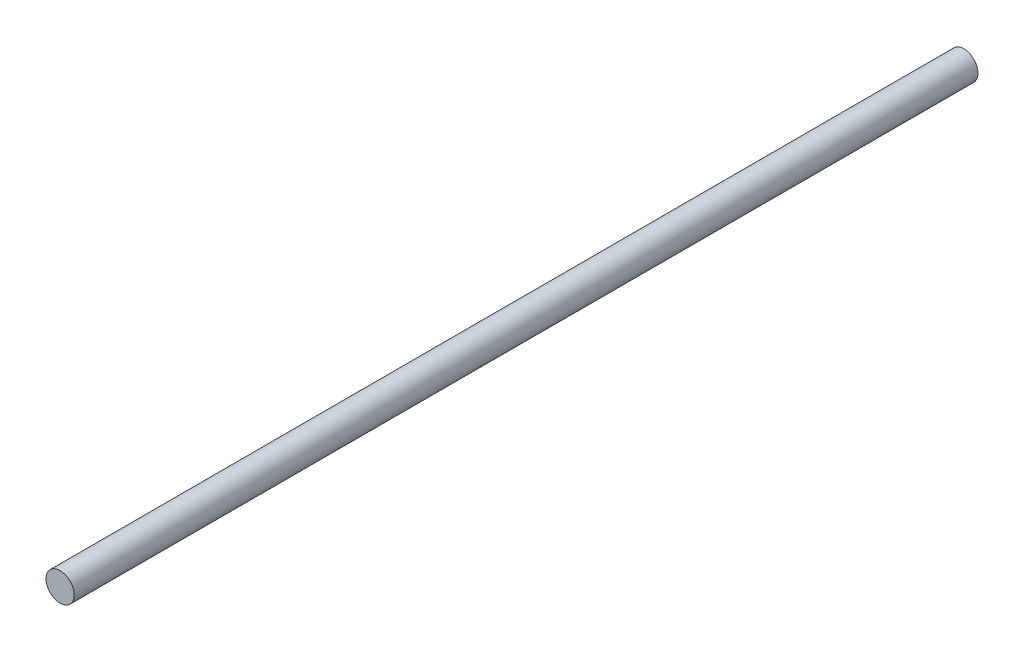
ISO-10303-21;
HEADER;
FILE_DESCRIPTION(('STEP AP214'),'2;1');
FILE_NAME('part.step','',(''),(''),'','','');
FILE_SCHEMA(('AUTOMOTIVE_DESIGN { 1 0 10303 214 1 1 1 1 }'));
ENDSEC;
DATA;
#1=APPLICATION_CONTEXT('core data for automotive mechanical design processes');
#2=APPLICATION_PROTOCOL_DEFINITION('international standard','automotive_design',2000,#1);
#3=PRODUCT_CONTEXT('',#1,'mechanical');
#4=PRODUCT('Part','Part','',(#3));
#5=PRODUCT_RELATED_PRODUCT_CATEGORY('part','',(#4));
#6=PRODUCT_DEFINITION_FORMATION('','',#4);
#7=PRODUCT_DEFINITION_CONTEXT('part definition',#1,'design');
#8=PRODUCT_DEFINITION('design','',#6,#7);
#9=PRODUCT_DEFINITION_SHAPE('','',#8);
#10=(LENGTH_UNIT() NAMED_UNIT(*) SI_UNIT(.MILLI.,.METRE.));
#11=(NAMED_UNIT(*) PLANE_ANGLE_UNIT() SI_UNIT($,.RADIAN.));
#12=(NAMED_UNIT(*) SI_UNIT($,.STERADIAN.) SOLID_ANGLE_UNIT());
#13=UNCERTAINTY_MEASURE_WITH_UNIT(LENGTH_MEASURE(1.E-05),#10,'distance_accuracy_value','');
#14=(GEOMETRIC_REPRESENTATION_CONTEXT(3) GLOBAL_UNCERTAINTY_ASSIGNED_CONTEXT((#13)) GLOBAL_UNIT_ASSIGNED_CONTEXT((#10,
#11,#12)) REPRESENTATION_CONTEXT('',''));
#15=CARTESIAN_POINT('',(0.,0.,0.));
#16=DIRECTION('',(0.,0.,1.));
#17=DIRECTION('',(1.,0.,0.));
#18=AXIS2_PLACEMENT_3D('',#15,#16,#17);
#19=CARTESIAN_POINT('',(0.,0.,203.2));
#20=DIRECTION('',(0.,0.,-1.));
#21=DIRECTION('',(-1.,0.,0.));
#22=AXIS2_PLACEMENT_3D('',#19,#20,#21);
#23=CYLINDRICAL_SURFACE('',#22,3.175);
#24=CARTESIAN_POINT('',(0.,0.,203.2));
#25=DIRECTION('',(0.,0.,1.));
#26=DIRECTION('',(1.,0.,0.));
#27=AXIS2_PLACEMENT_3D('',#24,#25,#26);
#28=CIRCLE('',#27,3.175);
#29=CARTESIAN_POINT('',(3.175,0.,203.2));
#30=VERTEX_POINT('',#29);
#31=EDGE_CURVE('E10',#30,#30,#28,.T.);
#32=ORIENTED_EDGE('',*,*,#31,.F.);
#33=EDGE_LOOP('',(#32));
#34=FACE_BOUND('',#33,.T.);
#35=CARTESIAN_POINT('',(0.,0.,0.));
#36=DIRECTION('',(0.,0.,1.));
#37=DIRECTION('',(1.,0.,0.));
#38=AXIS2_PLACEMENT_3D('',#35,#36,#37);
#39=CIRCLE('',#38,3.175);
#40=CARTESIAN_POINT('',(3.175,0.,0.));
#41=VERTEX_POINT('',#40);
#42=EDGE_CURVE('E38',#41,#41,#39,.T.);
#43=ORIENTED_EDGE('',*,*,#42,.T.);
#44=EDGE_LOOP('',(#43));
#45=FACE_BOUND('',#44,.T.);
#46=ADVANCED_FACE('F35',(#34,#45),#23,.T.);
#47=CARTESIAN_POINT('',(0.,0.,203.2));
#48=DIRECTION('',(0.,0.,1.));
#49=DIRECTION('',(1.,0.,0.));
#50=AXIS2_PLACEMENT_3D('',#47,#48,#49);
#51=PLANE('',#50);
#52=ORIENTED_EDGE('',*,*,#31,.T.);
#53=EDGE_LOOP('',(#52));
#54=FACE_BOUND('',#53,.T.);
#55=ADVANCED_FACE('F50',(#54),#51,.T.);
#56=CARTESIAN_POINT('',(0.,0.,0.));
#57=DIRECTION('',(0.,0.,1.));
#58=DIRECTION('',(1.,0.,0.));
#59=AXIS2_PLACEMENT_3D('',#56,#57,#58);
#60=PLANE('',#59);
#61=ORIENTED_EDGE('',*,*,#42,.F.);
#62=EDGE_LOOP('',(#61));
#63=FACE_BOUND('',#62,.T.);
#64=ADVANCED_FACE('F48',(#63),#60,.F.);
#65=CLOSED_SHELL('',(#46,#55,#64));
#66=MANIFOLD_SOLID_BREP('B2',#65);
#67=ADVANCED_BREP_SHAPE_REPRESENTATION('',(#18,#66),#14);
#68=SHAPE_DEFINITION_REPRESENTATION(#9,#67);
ENDSEC;
END-ISO-10303-21;
